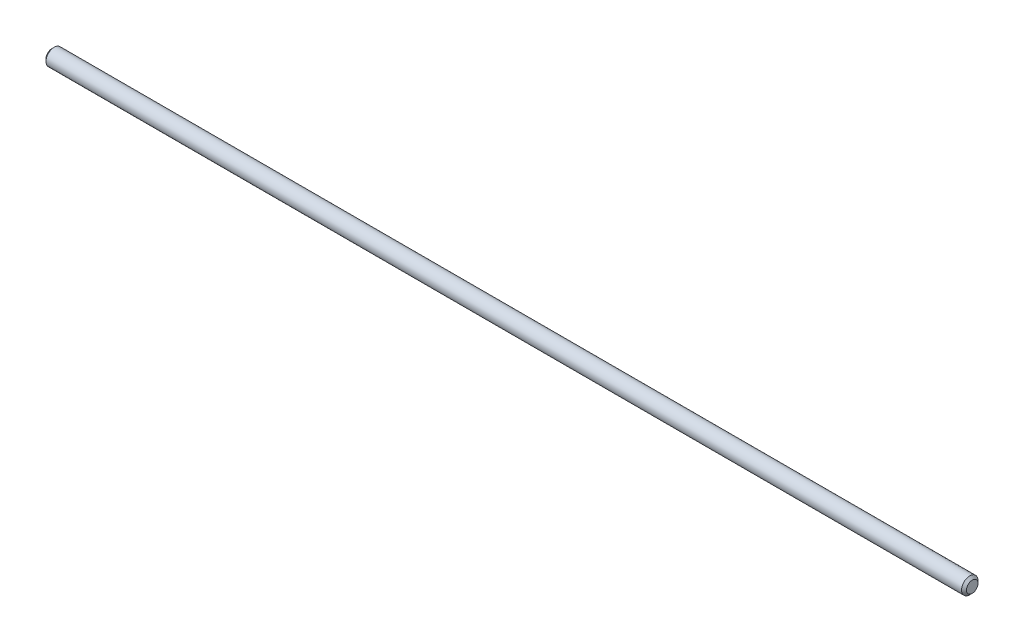
ISO-10303-21;
HEADER;
FILE_DESCRIPTION(('STEP AP214'),'2;1');
FILE_NAME('part.step','',(''),(''),'','','');
FILE_SCHEMA(('AUTOMOTIVE_DESIGN { 1 0 10303 214 1 1 1 1 }'));
ENDSEC;
DATA;
#1=APPLICATION_CONTEXT('core data for automotive mechanical design processes');
#2=APPLICATION_PROTOCOL_DEFINITION('international standard','automotive_design',2000,#1);
#3=PRODUCT_CONTEXT('',#1,'mechanical');
#4=PRODUCT('Part','Part','',(#3));
#5=PRODUCT_RELATED_PRODUCT_CATEGORY('part','',(#4));
#6=PRODUCT_DEFINITION_FORMATION('','',#4);
#7=PRODUCT_DEFINITION_CONTEXT('part definition',#1,'design');
#8=PRODUCT_DEFINITION('design','',#6,#7);
#9=PRODUCT_DEFINITION_SHAPE('','',#8);
#10=(LENGTH_UNIT() NAMED_UNIT(*) SI_UNIT(.MILLI.,.METRE.));
#11=(NAMED_UNIT(*) PLANE_ANGLE_UNIT() SI_UNIT($,.RADIAN.));
#12=(NAMED_UNIT(*) SI_UNIT($,.STERADIAN.) SOLID_ANGLE_UNIT());
#13=UNCERTAINTY_MEASURE_WITH_UNIT(LENGTH_MEASURE(1.E-05),#10,'distance_accuracy_value','');
#14=(GEOMETRIC_REPRESENTATION_CONTEXT(3) GLOBAL_UNCERTAINTY_ASSIGNED_CONTEXT((#13)) GLOBAL_UNIT_ASSIGNED_CONTEXT((#10,
#11,#12)) REPRESENTATION_CONTEXT('',''));
#15=CARTESIAN_POINT('',(0.,0.,0.));
#16=DIRECTION('',(0.,0.,1.));
#17=DIRECTION('',(1.,0.,0.));
#18=AXIS2_PLACEMENT_3D('',#15,#16,#17);
#19=CARTESIAN_POINT('',(-177.8,0.,0.));
#20=DIRECTION('',(1.,0.,0.));
#21=DIRECTION('',(0.,0.,-1.));
#22=AXIS2_PLACEMENT_3D('',#19,#20,#21);
#23=CYLINDRICAL_SURFACE('',#22,3.175);
#24=CARTESIAN_POINT('',(-176.8475,0.,0.));
#25=DIRECTION('',(1.,0.,0.));
#26=DIRECTION('',(0.,0.,-1.));
#27=AXIS2_PLACEMENT_3D('',#24,#25,#26);
#28=CIRCLE('',#27,3.175);
#29=CARTESIAN_POINT('',(-176.8475,0.,-3.175));
#30=VERTEX_POINT('',#29);
#31=EDGE_CURVE('E57',#30,#30,#28,.T.);
#32=ORIENTED_EDGE('',*,*,#31,.T.);
#33=EDGE_LOOP('',(#32));
#34=FACE_BOUND('',#33,.T.);
#35=CARTESIAN_POINT('',(176.8475,0.,0.));
#36=DIRECTION('',(1.,0.,0.));
#37=DIRECTION('',(0.,0.,-1.));
#38=AXIS2_PLACEMENT_3D('',#35,#36,#37);
#39=CIRCLE('',#38,3.175);
#40=CARTESIAN_POINT('',(176.8475,0.,-3.175));
#41=VERTEX_POINT('',#40);
#42=EDGE_CURVE('E61',#41,#41,#39,.F.);
#43=ORIENTED_EDGE('',*,*,#42,.T.);
#44=EDGE_LOOP('',(#43));
#45=FACE_BOUND('',#44,.T.);
#46=ADVANCED_FACE('F46',(#34,#45),#23,.T.);
#47=CARTESIAN_POINT('',(-177.8,0.,0.));
#48=DIRECTION('',(1.,0.,0.));
#49=DIRECTION('',(0.,0.,-1.));
#50=AXIS2_PLACEMENT_3D('',#47,#48,#49);
#51=PLANE('',#50);
#52=CARTESIAN_POINT('',(-177.8,0.,0.));
#53=DIRECTION('',(1.,0.,0.));
#54=DIRECTION('',(0.,0.,-1.));
#55=AXIS2_PLACEMENT_3D('',#52,#53,#54);
#56=CIRCLE('',#55,2.22249999999996);
#57=CARTESIAN_POINT('',(-177.8,0.,-2.22249999999996));
#58=VERTEX_POINT('',#57);
#59=EDGE_CURVE('E53',#58,#58,#56,.F.);
#60=ORIENTED_EDGE('',*,*,#59,.T.);
#61=EDGE_LOOP('',(#60));
#62=FACE_BOUND('',#61,.T.);
#63=ADVANCED_FACE('F77',(#62),#51,.F.);
#64=CARTESIAN_POINT('',(177.8,0.,0.));
#65=DIRECTION('',(1.,0.,0.));
#66=DIRECTION('',(0.,0.,-1.));
#67=AXIS2_PLACEMENT_3D('',#64,#65,#66);
#68=PLANE('',#67);
#69=CARTESIAN_POINT('',(177.8,0.,0.));
#70=DIRECTION('',(1.,0.,0.));
#71=DIRECTION('',(0.,0.,-1.));
#72=AXIS2_PLACEMENT_3D('',#69,#70,#71);
#73=CIRCLE('',#72,2.22249999999996);
#74=CARTESIAN_POINT('',(177.8,0.,-2.22249999999996));
#75=VERTEX_POINT('',#74);
#76=EDGE_CURVE('E12',#75,#75,#73,.T.);
#77=ORIENTED_EDGE('',*,*,#76,.T.);
#78=EDGE_LOOP('',(#77));
#79=FACE_BOUND('',#78,.T.);
#80=ADVANCED_FACE('F74',(#79),#68,.T.);
#81=CARTESIAN_POINT('',(-176.8475,0.,0.));
#82=DIRECTION('',(1.,0.,0.));
#83=DIRECTION('',(0.,0.,-1.));
#84=AXIS2_PLACEMENT_3D('',#81,#82,#83);
#85=CONICAL_SURFACE('',#84,3.175,0.785398163397457);
#86=ORIENTED_EDGE('',*,*,#59,.F.);
#87=EDGE_LOOP('',(#86));
#88=FACE_BOUND('',#87,.T.);
#89=ORIENTED_EDGE('',*,*,#31,.F.);
#90=EDGE_LOOP('',(#89));
#91=FACE_BOUND('',#90,.T.);
#92=ADVANCED_FACE('F70',(#88,#91),#85,.T.);
#93=CARTESIAN_POINT('',(177.8,0.,0.));
#94=DIRECTION('',(-1.,0.,0.));
#95=DIRECTION('',(0.,0.,1.));
#96=AXIS2_PLACEMENT_3D('',#93,#94,#95);
#97=CONICAL_SURFACE('',#96,2.22249999999996,0.785398163397428);
#98=ORIENTED_EDGE('',*,*,#42,.F.);
#99=EDGE_LOOP('',(#98));
#100=FACE_BOUND('',#99,.T.);
#101=ORIENTED_EDGE('',*,*,#76,.F.);
#102=EDGE_LOOP('',(#101));
#103=FACE_BOUND('',#102,.T.);
#104=ADVANCED_FACE('F48',(#100,#103),#97,.T.);
#105=CLOSED_SHELL('',(#46,#63,#80,#92,#104));
#106=MANIFOLD_SOLID_BREP('B2',#105);
#107=ADVANCED_BREP_SHAPE_REPRESENTATION('',(#18,#106),#14);
#108=SHAPE_DEFINITION_REPRESENTATION(#9,#107);
ENDSEC;
END-ISO-10303-21;
